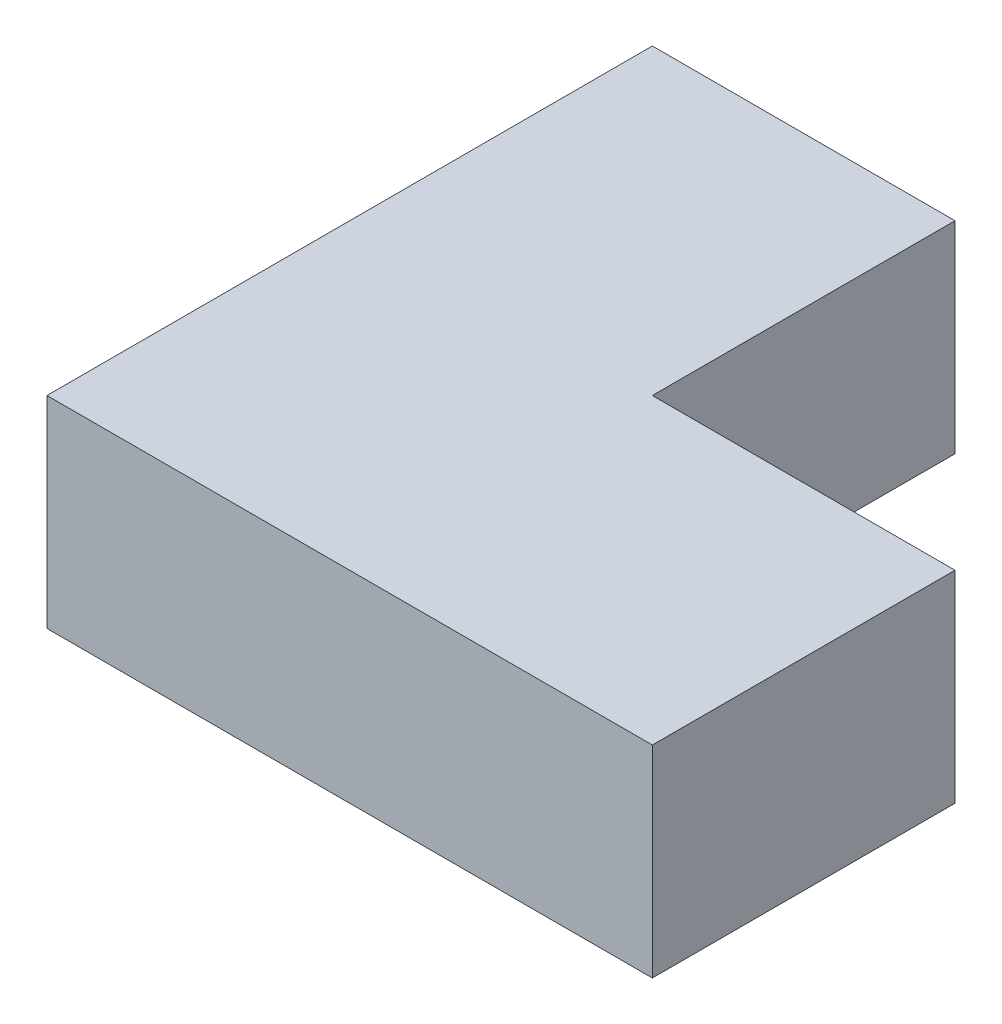
ISO-10303-21;
HEADER;
FILE_DESCRIPTION(('STEP AP214'),'2;1');
FILE_NAME('part.step','',(''),(''),'','','');
FILE_SCHEMA(('AUTOMOTIVE_DESIGN { 1 0 10303 214 1 1 1 1 }'));
ENDSEC;
DATA;
#1=APPLICATION_CONTEXT('core data for automotive mechanical design processes');
#2=APPLICATION_PROTOCOL_DEFINITION('international standard','automotive_design',2000,#1);
#3=PRODUCT_CONTEXT('',#1,'mechanical');
#4=PRODUCT('Part','Part','',(#3));
#5=PRODUCT_RELATED_PRODUCT_CATEGORY('part','',(#4));
#6=PRODUCT_DEFINITION_FORMATION('','',#4);
#7=PRODUCT_DEFINITION_CONTEXT('part definition',#1,'design');
#8=PRODUCT_DEFINITION('design','',#6,#7);
#9=PRODUCT_DEFINITION_SHAPE('','',#8);
#10=(LENGTH_UNIT() NAMED_UNIT(*) SI_UNIT(.MILLI.,.METRE.));
#11=(NAMED_UNIT(*) PLANE_ANGLE_UNIT() SI_UNIT($,.RADIAN.));
#12=(NAMED_UNIT(*) SI_UNIT($,.STERADIAN.) SOLID_ANGLE_UNIT());
#13=UNCERTAINTY_MEASURE_WITH_UNIT(LENGTH_MEASURE(1.E-05),#10,'distance_accuracy_value','');
#14=(GEOMETRIC_REPRESENTATION_CONTEXT(3) GLOBAL_UNCERTAINTY_ASSIGNED_CONTEXT((#13)) GLOBAL_UNIT_ASSIGNED_CONTEXT((#10,
#11,#12)) REPRESENTATION_CONTEXT('',''));
#15=CARTESIAN_POINT('',(0.,0.,0.));
#16=DIRECTION('',(0.,0.,1.));
#17=DIRECTION('',(1.,0.,0.));
#18=AXIS2_PLACEMENT_3D('',#15,#16,#17);
#19=CARTESIAN_POINT('',(0.,0.2,0.));
#20=DIRECTION('',(0.,1.,0.));
#21=DIRECTION('',(1.,0.,0.));
#22=AXIS2_PLACEMENT_3D('',#19,#20,#21);
#23=PLANE('',#22);
#24=DIRECTION('',(-1.,0.,0.));
#25=VECTOR('',#24,1.);
#26=CARTESIAN_POINT('',(1.5,0.2,-1.35));
#27=LINE('',#26,#25);
#28=CARTESIAN_POINT('',(1.5,0.2,-1.35));
#29=VERTEX_POINT('',#28);
#30=CARTESIAN_POINT('',(1.35,0.2,-1.35));
#31=VERTEX_POINT('',#30);
#32=EDGE_CURVE('E11',#29,#31,#27,.T.);
#33=ORIENTED_EDGE('',*,*,#32,.T.);
#34=DIRECTION('',(0.,0.,-1.));
#35=VECTOR('',#34,1.);
#36=CARTESIAN_POINT('',(1.35,0.2,-1.35));
#37=LINE('',#36,#35);
#38=CARTESIAN_POINT('',(1.35,0.2,-1.5));
#39=VERTEX_POINT('',#38);
#40=EDGE_CURVE('E24',#31,#39,#37,.T.);
#41=ORIENTED_EDGE('',*,*,#40,.T.);
#42=DIRECTION('',(-1.,0.,0.));
#43=VECTOR('',#42,1.);
#44=CARTESIAN_POINT('',(1.35,0.2,-1.5));
#45=LINE('',#44,#43);
#46=CARTESIAN_POINT('',(1.2,0.2,-1.5));
#47=VERTEX_POINT('',#46);
#48=EDGE_CURVE('E116',#39,#47,#45,.T.);
#49=ORIENTED_EDGE('',*,*,#48,.T.);
#50=DIRECTION('',(0.,0.,1.));
#51=VECTOR('',#50,1.);
#52=CARTESIAN_POINT('',(1.2,0.2,-1.5));
#53=LINE('',#52,#51);
#54=CARTESIAN_POINT('',(1.2,0.2,-1.2));
#55=VERTEX_POINT('',#54);
#56=EDGE_CURVE('E114',#47,#55,#53,.T.);
#57=ORIENTED_EDGE('',*,*,#56,.T.);
#58=DIRECTION('',(1.,0.,0.));
#59=VECTOR('',#58,1.);
#60=CARTESIAN_POINT('',(1.2,0.2,-1.2));
#61=LINE('',#60,#59);
#62=CARTESIAN_POINT('',(1.5,0.2,-1.2));
#63=VERTEX_POINT('',#62);
#64=EDGE_CURVE('E74',#55,#63,#61,.T.);
#65=ORIENTED_EDGE('',*,*,#64,.T.);
#66=DIRECTION('',(0.,0.,-1.));
#67=VECTOR('',#66,1.);
#68=CARTESIAN_POINT('',(1.5,0.2,-1.2));
#69=LINE('',#68,#67);
#70=EDGE_CURVE('E36',#63,#29,#69,.T.);
#71=ORIENTED_EDGE('',*,*,#70,.T.);
#72=EDGE_LOOP('',(#33,#41,#49,#57,#65,#71));
#73=FACE_BOUND('',#72,.T.);
#74=ADVANCED_FACE('F17',(#73),#23,.T.);
#75=CARTESIAN_POINT('',(1.5,0.2,-1.2));
#76=DIRECTION('',(1.,0.,0.));
#77=DIRECTION('',(0.,0.,-1.));
#78=AXIS2_PLACEMENT_3D('',#75,#76,#77);
#79=PLANE('',#78);
#80=DIRECTION('',(0.,-1.,0.));
#81=VECTOR('',#80,1.);
#82=CARTESIAN_POINT('',(1.5,0.2,-1.2));
#83=LINE('',#82,#81);
#84=CARTESIAN_POINT('',(1.5,0.1,-1.2));
#85=VERTEX_POINT('',#84);
#86=EDGE_CURVE('E110',#63,#85,#83,.T.);
#87=ORIENTED_EDGE('',*,*,#86,.T.);
#88=DIRECTION('',(0.,0.,-1.));
#89=VECTOR('',#88,1.);
#90=CARTESIAN_POINT('',(1.5,0.1,-1.2));
#91=LINE('',#90,#89);
#92=CARTESIAN_POINT('',(1.5,0.1,-1.35));
#93=VERTEX_POINT('',#92);
#94=EDGE_CURVE('E90',#85,#93,#91,.T.);
#95=ORIENTED_EDGE('',*,*,#94,.T.);
#96=DIRECTION('',(0.,-1.,0.));
#97=VECTOR('',#96,1.);
#98=CARTESIAN_POINT('',(1.5,0.2,-1.35));
#99=LINE('',#98,#97);
#100=EDGE_CURVE('E107',#29,#93,#99,.T.);
#101=ORIENTED_EDGE('',*,*,#100,.F.);
#102=ORIENTED_EDGE('',*,*,#70,.F.);
#103=EDGE_LOOP('',(#87,#95,#101,#102));
#104=FACE_BOUND('',#103,.T.);
#105=ADVANCED_FACE('F127',(#104),#79,.T.);
#106=CARTESIAN_POINT('',(1.5,0.2,-1.35));
#107=DIRECTION('',(0.,0.,-1.));
#108=DIRECTION('',(-1.,0.,0.));
#109=AXIS2_PLACEMENT_3D('',#106,#107,#108);
#110=PLANE('',#109);
#111=ORIENTED_EDGE('',*,*,#100,.T.);
#112=DIRECTION('',(-1.,0.,0.));
#113=VECTOR('',#112,1.);
#114=CARTESIAN_POINT('',(1.5,0.1,-1.35));
#115=LINE('',#114,#113);
#116=CARTESIAN_POINT('',(1.35,0.1,-1.35));
#117=VERTEX_POINT('',#116);
#118=EDGE_CURVE('E104',#93,#117,#115,.T.);
#119=ORIENTED_EDGE('',*,*,#118,.T.);
#120=DIRECTION('',(0.,-1.,0.));
#121=VECTOR('',#120,1.);
#122=CARTESIAN_POINT('',(1.35,0.2,-1.35));
#123=LINE('',#122,#121);
#124=EDGE_CURVE('E102',#31,#117,#123,.T.);
#125=ORIENTED_EDGE('',*,*,#124,.F.);
#126=ORIENTED_EDGE('',*,*,#32,.F.);
#127=EDGE_LOOP('',(#111,#119,#125,#126));
#128=FACE_BOUND('',#127,.T.);
#129=ADVANCED_FACE('F124',(#128),#110,.T.);
#130=CARTESIAN_POINT('',(1.35,0.2,-1.35));
#131=DIRECTION('',(1.,0.,0.));
#132=DIRECTION('',(0.,0.,-1.));
#133=AXIS2_PLACEMENT_3D('',#130,#131,#132);
#134=PLANE('',#133);
#135=ORIENTED_EDGE('',*,*,#124,.T.);
#136=DIRECTION('',(0.,0.,-1.));
#137=VECTOR('',#136,1.);
#138=CARTESIAN_POINT('',(1.35,0.1,-1.35));
#139=LINE('',#138,#137);
#140=CARTESIAN_POINT('',(1.35,0.1,-1.5));
#141=VERTEX_POINT('',#140);
#142=EDGE_CURVE('E99',#117,#141,#139,.T.);
#143=ORIENTED_EDGE('',*,*,#142,.T.);
#144=DIRECTION('',(0.,-1.,0.));
#145=VECTOR('',#144,1.);
#146=CARTESIAN_POINT('',(1.35,0.2,-1.5));
#147=LINE('',#146,#145);
#148=EDGE_CURVE('E97',#39,#141,#147,.T.);
#149=ORIENTED_EDGE('',*,*,#148,.F.);
#150=ORIENTED_EDGE('',*,*,#40,.F.);
#151=EDGE_LOOP('',(#135,#143,#149,#150));
#152=FACE_BOUND('',#151,.T.);
#153=ADVANCED_FACE('F119',(#152),#134,.T.);
#154=CARTESIAN_POINT('',(1.35,0.2,-1.5));
#155=DIRECTION('',(0.,0.,-1.));
#156=DIRECTION('',(-1.,0.,0.));
#157=AXIS2_PLACEMENT_3D('',#154,#155,#156);
#158=PLANE('',#157);
#159=ORIENTED_EDGE('',*,*,#148,.T.);
#160=DIRECTION('',(-1.,0.,0.));
#161=VECTOR('',#160,1.);
#162=CARTESIAN_POINT('',(1.35,0.1,-1.5));
#163=LINE('',#162,#161);
#164=CARTESIAN_POINT('',(1.2,0.1,-1.5));
#165=VERTEX_POINT('',#164);
#166=EDGE_CURVE('E95',#141,#165,#163,.T.);
#167=ORIENTED_EDGE('',*,*,#166,.T.);
#168=DIRECTION('',(0.,-1.,0.));
#169=VECTOR('',#168,1.);
#170=CARTESIAN_POINT('',(1.2,0.2,-1.5));
#171=LINE('',#170,#169);
#172=EDGE_CURVE('E82',#47,#165,#171,.T.);
#173=ORIENTED_EDGE('',*,*,#172,.F.);
#174=ORIENTED_EDGE('',*,*,#48,.F.);
#175=EDGE_LOOP('',(#159,#167,#173,#174));
#176=FACE_BOUND('',#175,.T.);
#177=ADVANCED_FACE('F122',(#176),#158,.T.);
#178=CARTESIAN_POINT('',(1.2,0.2,-1.5));
#179=DIRECTION('',(-1.,0.,0.));
#180=DIRECTION('',(0.,0.,1.));
#181=AXIS2_PLACEMENT_3D('',#178,#179,#180);
#182=PLANE('',#181);
#183=ORIENTED_EDGE('',*,*,#172,.T.);
#184=DIRECTION('',(0.,0.,1.));
#185=VECTOR('',#184,1.);
#186=CARTESIAN_POINT('',(1.2,0.1,-1.5));
#187=LINE('',#186,#185);
#188=CARTESIAN_POINT('',(1.2,0.1,-1.2));
#189=VERTEX_POINT('',#188);
#190=EDGE_CURVE('E77',#165,#189,#187,.T.);
#191=ORIENTED_EDGE('',*,*,#190,.T.);
#192=DIRECTION('',(0.,-1.,0.));
#193=VECTOR('',#192,1.);
#194=CARTESIAN_POINT('',(1.2,0.2,-1.2));
#195=LINE('',#194,#193);
#196=EDGE_CURVE('E68',#55,#189,#195,.T.);
#197=ORIENTED_EDGE('',*,*,#196,.F.);
#198=ORIENTED_EDGE('',*,*,#56,.F.);
#199=EDGE_LOOP('',(#183,#191,#197,#198));
#200=FACE_BOUND('',#199,.T.);
#201=ADVANCED_FACE('F80',(#200),#182,.T.);
#202=CARTESIAN_POINT('',(1.2,0.2,-1.2));
#203=DIRECTION('',(0.,0.,1.));
#204=DIRECTION('',(1.,0.,0.));
#205=AXIS2_PLACEMENT_3D('',#202,#203,#204);
#206=PLANE('',#205);
#207=ORIENTED_EDGE('',*,*,#196,.T.);
#208=DIRECTION('',(1.,0.,0.));
#209=VECTOR('',#208,1.);
#210=CARTESIAN_POINT('',(1.2,0.1,-1.2));
#211=LINE('',#210,#209);
#212=EDGE_CURVE('E73',#189,#85,#211,.T.);
#213=ORIENTED_EDGE('',*,*,#212,.T.);
#214=ORIENTED_EDGE('',*,*,#86,.F.);
#215=ORIENTED_EDGE('',*,*,#64,.F.);
#216=EDGE_LOOP('',(#207,#213,#214,#215));
#217=FACE_BOUND('',#216,.T.);
#218=ADVANCED_FACE('F70',(#217),#206,.T.);
#219=CARTESIAN_POINT('',(0.,0.1,0.));
#220=DIRECTION('',(0.,1.,0.));
#221=DIRECTION('',(1.,0.,0.));
#222=AXIS2_PLACEMENT_3D('',#219,#220,#221);
#223=PLANE('',#222);
#224=ORIENTED_EDGE('',*,*,#212,.F.);
#225=ORIENTED_EDGE('',*,*,#190,.F.);
#226=ORIENTED_EDGE('',*,*,#166,.F.);
#227=ORIENTED_EDGE('',*,*,#142,.F.);
#228=ORIENTED_EDGE('',*,*,#118,.F.);
#229=ORIENTED_EDGE('',*,*,#94,.F.);
#230=EDGE_LOOP('',(#224,#225,#226,#227,#228,#229));
#231=FACE_BOUND('',#230,.T.);
#232=ADVANCED_FACE('F87',(#231),#223,.F.);
#233=CLOSED_SHELL('',(#74,#105,#129,#153,#177,#201,#218,#232));
#234=MANIFOLD_SOLID_BREP('B1',#233);
#235=ADVANCED_BREP_SHAPE_REPRESENTATION('',(#18,#234),#14);
#236=SHAPE_DEFINITION_REPRESENTATION(#9,#235);
ENDSEC;
END-ISO-10303-21;
